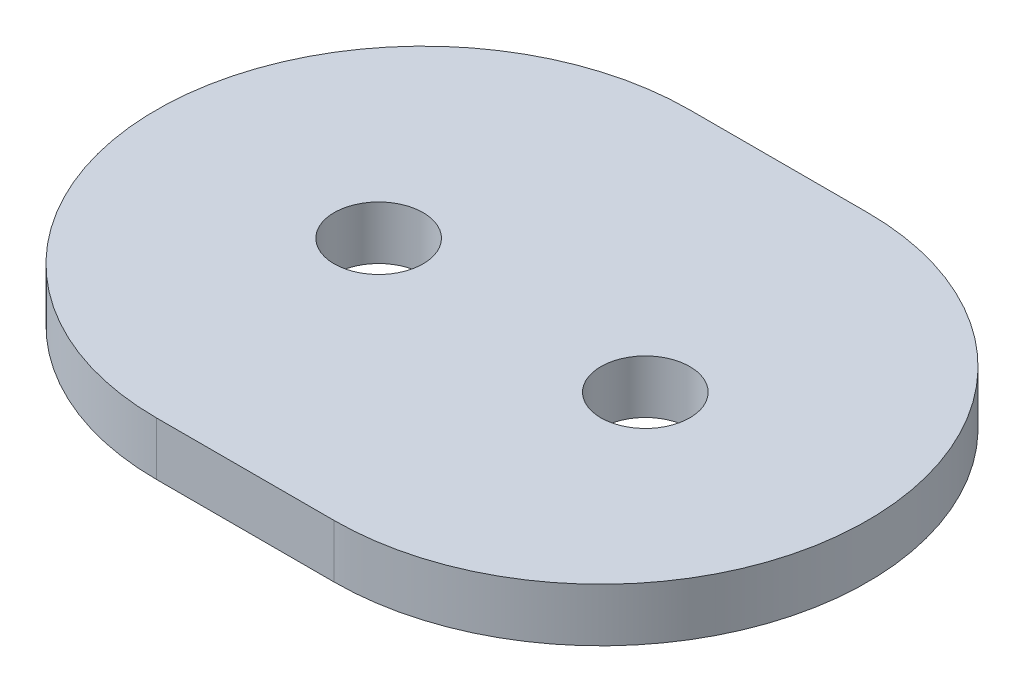
ISO-10303-21;
HEADER;
FILE_DESCRIPTION(('STEP AP214'),'2;1');
FILE_NAME('part.step','',(''),(''),'','','');
FILE_SCHEMA(('AUTOMOTIVE_DESIGN { 1 0 10303 214 1 1 1 1 }'));
ENDSEC;
DATA;
#1=APPLICATION_CONTEXT('core data for automotive mechanical design processes');
#2=APPLICATION_PROTOCOL_DEFINITION('international standard','automotive_design',2000,#1);
#3=PRODUCT_CONTEXT('',#1,'mechanical');
#4=PRODUCT('Part','Part','',(#3));
#5=PRODUCT_RELATED_PRODUCT_CATEGORY('part','',(#4));
#6=PRODUCT_DEFINITION_FORMATION('','',#4);
#7=PRODUCT_DEFINITION_CONTEXT('part definition',#1,'design');
#8=PRODUCT_DEFINITION('design','',#6,#7);
#9=PRODUCT_DEFINITION_SHAPE('','',#8);
#10=(LENGTH_UNIT() NAMED_UNIT(*) SI_UNIT(.MILLI.,.METRE.));
#11=(NAMED_UNIT(*) PLANE_ANGLE_UNIT() SI_UNIT($,.RADIAN.));
#12=(NAMED_UNIT(*) SI_UNIT($,.STERADIAN.) SOLID_ANGLE_UNIT());
#13=UNCERTAINTY_MEASURE_WITH_UNIT(LENGTH_MEASURE(1.E-05),#10,'distance_accuracy_value','');
#14=(GEOMETRIC_REPRESENTATION_CONTEXT(3) GLOBAL_UNCERTAINTY_ASSIGNED_CONTEXT((#13)) GLOBAL_UNIT_ASSIGNED_CONTEXT((#10,
#11,#12)) REPRESENTATION_CONTEXT('',''));
#15=CARTESIAN_POINT('',(0.,0.,0.));
#16=DIRECTION('',(0.,0.,1.));
#17=DIRECTION('',(1.,0.,0.));
#18=AXIS2_PLACEMENT_3D('',#15,#16,#17);
#19=CARTESIAN_POINT('',(-5.,3.,0.));
#20=DIRECTION('',(0.,1.,0.));
#21=DIRECTION('',(0.,0.,1.));
#22=AXIS2_PLACEMENT_3D('',#19,#20,#21);
#23=PLANE('',#22);
#24=CARTESIAN_POINT('',(-7.5,3.,0.));
#25=DIRECTION('',(0.,1.,0.));
#26=DIRECTION('',(0.,0.,1.));
#27=AXIS2_PLACEMENT_3D('',#24,#25,#26);
#28=CIRCLE('',#27,2.5);
#29=CARTESIAN_POINT('',(-7.5,3.,2.5));
#30=VERTEX_POINT('',#29);
#31=EDGE_CURVE('E100',#30,#30,#28,.T.);
#32=ORIENTED_EDGE('',*,*,#31,.F.);
#33=EDGE_LOOP('',(#32));
#34=FACE_BOUND('',#33,.T.);
#35=CARTESIAN_POINT('',(-5.,3.,0.));
#36=DIRECTION('',(0.,1.,0.));
#37=DIRECTION('',(0.,0.,1.));
#38=AXIS2_PLACEMENT_3D('',#35,#36,#37);
#39=CIRCLE('',#38,15.);
#40=CARTESIAN_POINT('',(-5.,3.,-15.));
#41=VERTEX_POINT('',#40);
#42=CARTESIAN_POINT('',(-5.,3.,15.));
#43=VERTEX_POINT('',#42);
#44=EDGE_CURVE('E85',#41,#43,#39,.T.);
#45=ORIENTED_EDGE('',*,*,#44,.T.);
#46=DIRECTION('',(1.,0.,0.));
#47=VECTOR('',#46,1.);
#48=CARTESIAN_POINT('',(-5.,3.,15.));
#49=LINE('',#48,#47);
#50=CARTESIAN_POINT('',(5.00000000000001,3.,15.));
#51=VERTEX_POINT('',#50);
#52=EDGE_CURVE('E80',#43,#51,#49,.T.);
#53=ORIENTED_EDGE('',*,*,#52,.T.);
#54=CARTESIAN_POINT('',(5.,3.,0.));
#55=DIRECTION('',(0.,1.,0.));
#56=DIRECTION('',(0.,0.,1.));
#57=AXIS2_PLACEMENT_3D('',#54,#55,#56);
#58=CIRCLE('',#57,15.);
#59=CARTESIAN_POINT('',(4.99999999999999,3.,-15.));
#60=VERTEX_POINT('',#59);
#61=EDGE_CURVE('E83',#51,#60,#58,.T.);
#62=ORIENTED_EDGE('',*,*,#61,.T.);
#63=DIRECTION('',(-1.,0.,0.));
#64=VECTOR('',#63,1.);
#65=CARTESIAN_POINT('',(-5.,3.,-15.));
#66=LINE('',#65,#64);
#67=EDGE_CURVE('E50',#60,#41,#66,.T.);
#68=ORIENTED_EDGE('',*,*,#67,.T.);
#69=EDGE_LOOP('',(#45,#53,#62,#68));
#70=FACE_BOUND('',#69,.T.);
#71=CARTESIAN_POINT('',(7.5,3.,0.));
#72=DIRECTION('',(0.,1.,0.));
#73=DIRECTION('',(0.,0.,1.));
#74=AXIS2_PLACEMENT_3D('',#71,#72,#73);
#75=CIRCLE('',#74,2.5);
#76=CARTESIAN_POINT('',(7.5,3.,2.5));
#77=VERTEX_POINT('',#76);
#78=EDGE_CURVE('E115',#77,#77,#75,.T.);
#79=ORIENTED_EDGE('',*,*,#78,.F.);
#80=EDGE_LOOP('',(#79));
#81=FACE_BOUND('',#80,.T.);
#82=ADVANCED_FACE('F33',(#34,#70,#81),#23,.T.);
#83=CARTESIAN_POINT('',(-5.,0.,0.));
#84=DIRECTION('',(0.,1.,0.));
#85=DIRECTION('',(0.,0.,1.));
#86=AXIS2_PLACEMENT_3D('',#83,#84,#85);
#87=PLANE('',#86);
#88=CARTESIAN_POINT('',(-5.,0.,0.));
#89=DIRECTION('',(0.,1.,0.));
#90=DIRECTION('',(0.,0.,1.));
#91=AXIS2_PLACEMENT_3D('',#88,#89,#90);
#92=CIRCLE('',#91,15.);
#93=CARTESIAN_POINT('',(-5.,0.,-15.));
#94=VERTEX_POINT('',#93);
#95=CARTESIAN_POINT('',(-5.,0.,15.));
#96=VERTEX_POINT('',#95);
#97=EDGE_CURVE('E97',#94,#96,#92,.T.);
#98=ORIENTED_EDGE('',*,*,#97,.F.);
#99=DIRECTION('',(-1.,0.,0.));
#100=VECTOR('',#99,1.);
#101=CARTESIAN_POINT('',(-5.,0.,-15.));
#102=LINE('',#101,#100);
#103=CARTESIAN_POINT('',(4.99999999999999,0.,-15.));
#104=VERTEX_POINT('',#103);
#105=EDGE_CURVE('E73',#104,#94,#102,.T.);
#106=ORIENTED_EDGE('',*,*,#105,.F.);
#107=CARTESIAN_POINT('',(5.,0.,0.));
#108=DIRECTION('',(0.,1.,0.));
#109=DIRECTION('',(0.,0.,1.));
#110=AXIS2_PLACEMENT_3D('',#107,#108,#109);
#111=CIRCLE('',#110,15.);
#112=CARTESIAN_POINT('',(5.00000000000001,0.,15.));
#113=VERTEX_POINT('',#112);
#114=EDGE_CURVE('E67',#113,#104,#111,.T.);
#115=ORIENTED_EDGE('',*,*,#114,.F.);
#116=DIRECTION('',(1.,0.,0.));
#117=VECTOR('',#116,1.);
#118=CARTESIAN_POINT('',(-5.,0.,15.));
#119=LINE('',#118,#117);
#120=EDGE_CURVE('E89',#96,#113,#119,.T.);
#121=ORIENTED_EDGE('',*,*,#120,.F.);
#122=EDGE_LOOP('',(#98,#106,#115,#121));
#123=FACE_BOUND('',#122,.T.);
#124=CARTESIAN_POINT('',(-7.5,0.,0.));
#125=DIRECTION('',(0.,1.,0.));
#126=DIRECTION('',(0.,0.,1.));
#127=AXIS2_PLACEMENT_3D('',#124,#125,#126);
#128=CIRCLE('',#127,2.5);
#129=CARTESIAN_POINT('',(-7.5,0.,2.5));
#130=VERTEX_POINT('',#129);
#131=EDGE_CURVE('E112',#130,#130,#128,.T.);
#132=ORIENTED_EDGE('',*,*,#131,.T.);
#133=EDGE_LOOP('',(#132));
#134=FACE_BOUND('',#133,.T.);
#135=CARTESIAN_POINT('',(7.5,0.,0.));
#136=DIRECTION('',(0.,1.,0.));
#137=DIRECTION('',(0.,0.,1.));
#138=AXIS2_PLACEMENT_3D('',#135,#136,#137);
#139=CIRCLE('',#138,2.5);
#140=CARTESIAN_POINT('',(7.5,0.,2.5));
#141=VERTEX_POINT('',#140);
#142=EDGE_CURVE('E118',#141,#141,#139,.T.);
#143=ORIENTED_EDGE('',*,*,#142,.T.);
#144=EDGE_LOOP('',(#143));
#145=FACE_BOUND('',#144,.T.);
#146=ADVANCED_FACE('F108',(#123,#134,#145),#87,.F.);
#147=CARTESIAN_POINT('',(-5.,3.,0.));
#148=DIRECTION('',(0.,-1.,0.));
#149=DIRECTION('',(0.,0.,-1.));
#150=AXIS2_PLACEMENT_3D('',#147,#148,#149);
#151=CYLINDRICAL_SURFACE('',#150,15.);
#152=ORIENTED_EDGE('',*,*,#97,.T.);
#153=DIRECTION('',(0.,-1.,0.));
#154=VECTOR('',#153,1.);
#155=CARTESIAN_POINT('',(-5.,3.,15.));
#156=LINE('',#155,#154);
#157=EDGE_CURVE('E11',#43,#96,#156,.T.);
#158=ORIENTED_EDGE('',*,*,#157,.F.);
#159=ORIENTED_EDGE('',*,*,#44,.F.);
#160=DIRECTION('',(0.,-1.,0.));
#161=VECTOR('',#160,1.);
#162=CARTESIAN_POINT('',(-5.,3.,-15.));
#163=LINE('',#162,#161);
#164=EDGE_CURVE('E93',#41,#94,#163,.T.);
#165=ORIENTED_EDGE('',*,*,#164,.T.);
#166=EDGE_LOOP('',(#152,#158,#159,#165));
#167=FACE_BOUND('',#166,.T.);
#168=ADVANCED_FACE('F35',(#167),#151,.T.);
#169=CARTESIAN_POINT('',(-5.,3.,15.));
#170=DIRECTION('',(0.,0.,-1.));
#171=DIRECTION('',(-1.,0.,0.));
#172=AXIS2_PLACEMENT_3D('',#169,#170,#171);
#173=PLANE('',#172);
#174=ORIENTED_EDGE('',*,*,#120,.T.);
#175=DIRECTION('',(0.,-1.,0.));
#176=VECTOR('',#175,1.);
#177=CARTESIAN_POINT('',(5.00000000000001,3.,15.));
#178=LINE('',#177,#176);
#179=EDGE_CURVE('E42',#51,#113,#178,.T.);
#180=ORIENTED_EDGE('',*,*,#179,.F.);
#181=ORIENTED_EDGE('',*,*,#52,.F.);
#182=ORIENTED_EDGE('',*,*,#157,.T.);
#183=EDGE_LOOP('',(#174,#180,#181,#182));
#184=FACE_BOUND('',#183,.T.);
#185=ADVANCED_FACE('F88',(#184),#173,.F.);
#186=CARTESIAN_POINT('',(5.,3.,0.));
#187=DIRECTION('',(0.,-1.,0.));
#188=DIRECTION('',(0.,0.,-1.));
#189=AXIS2_PLACEMENT_3D('',#186,#187,#188);
#190=CYLINDRICAL_SURFACE('',#189,15.);
#191=ORIENTED_EDGE('',*,*,#114,.T.);
#192=DIRECTION('',(0.,-1.,0.));
#193=VECTOR('',#192,1.);
#194=CARTESIAN_POINT('',(4.99999999999999,3.,-15.));
#195=LINE('',#194,#193);
#196=EDGE_CURVE('E90',#60,#104,#195,.T.);
#197=ORIENTED_EDGE('',*,*,#196,.F.);
#198=ORIENTED_EDGE('',*,*,#61,.F.);
#199=ORIENTED_EDGE('',*,*,#179,.T.);
#200=EDGE_LOOP('',(#191,#197,#198,#199));
#201=FACE_BOUND('',#200,.T.);
#202=ADVANCED_FACE('F91',(#201),#190,.T.);
#203=CARTESIAN_POINT('',(-5.,3.,-15.));
#204=DIRECTION('',(0.,0.,1.));
#205=DIRECTION('',(1.,0.,0.));
#206=AXIS2_PLACEMENT_3D('',#203,#204,#205);
#207=PLANE('',#206);
#208=ORIENTED_EDGE('',*,*,#105,.T.);
#209=ORIENTED_EDGE('',*,*,#164,.F.);
#210=ORIENTED_EDGE('',*,*,#67,.F.);
#211=ORIENTED_EDGE('',*,*,#196,.T.);
#212=EDGE_LOOP('',(#208,#209,#210,#211));
#213=FACE_BOUND('',#212,.T.);
#214=ADVANCED_FACE('F105',(#213),#207,.F.);
#215=CARTESIAN_POINT('',(-7.5,3.,0.));
#216=DIRECTION('',(0.,-1.,0.));
#217=DIRECTION('',(0.,0.,-1.));
#218=AXIS2_PLACEMENT_3D('',#215,#216,#217);
#219=CYLINDRICAL_SURFACE('',#218,2.5);
#220=ORIENTED_EDGE('',*,*,#31,.T.);
#221=EDGE_LOOP('',(#220));
#222=FACE_BOUND('',#221,.T.);
#223=ORIENTED_EDGE('',*,*,#131,.F.);
#224=EDGE_LOOP('',(#223));
#225=FACE_BOUND('',#224,.T.);
#226=ADVANCED_FACE('F135',(#222,#225),#219,.F.);
#227=CARTESIAN_POINT('',(7.5,3.,0.));
#228=DIRECTION('',(0.,-1.,0.));
#229=DIRECTION('',(0.,0.,-1.));
#230=AXIS2_PLACEMENT_3D('',#227,#228,#229);
#231=CYLINDRICAL_SURFACE('',#230,2.5);
#232=ORIENTED_EDGE('',*,*,#78,.T.);
#233=EDGE_LOOP('',(#232));
#234=FACE_BOUND('',#233,.T.);
#235=ORIENTED_EDGE('',*,*,#142,.F.);
#236=EDGE_LOOP('',(#235));
#237=FACE_BOUND('',#236,.T.);
#238=ADVANCED_FACE('F124',(#234,#237),#231,.F.);
#239=CLOSED_SHELL('',(#82,#146,#168,#185,#202,#214,#226,#238));
#240=MANIFOLD_SOLID_BREP('B2',#239);
#241=ADVANCED_BREP_SHAPE_REPRESENTATION('',(#18,#240),#14);
#242=SHAPE_DEFINITION_REPRESENTATION(#9,#241);
ENDSEC;
END-ISO-10303-21;
